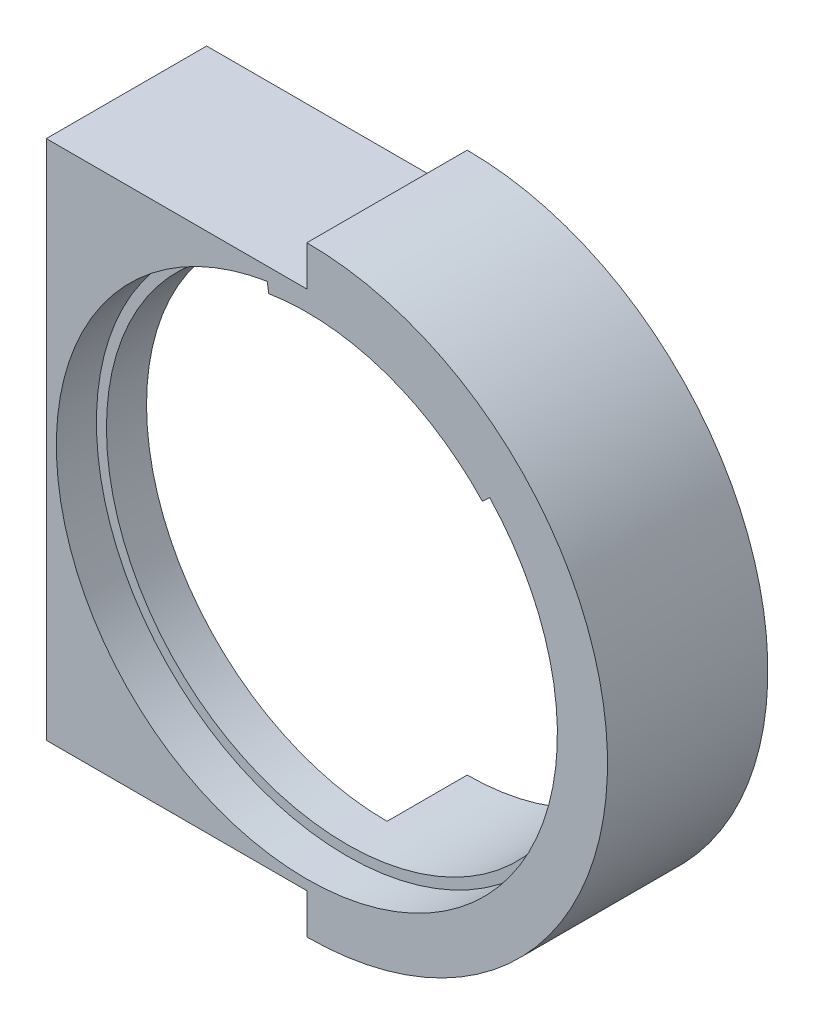
ISO-10303-21;
HEADER;
FILE_DESCRIPTION(('STEP AP214'),'2;1');
FILE_NAME('part.step','',(''),(''),'','','');
FILE_SCHEMA(('AUTOMOTIVE_DESIGN { 1 0 10303 214 1 1 1 1 }'));
ENDSEC;
DATA;
#1=APPLICATION_CONTEXT('core data for automotive mechanical design processes');
#2=APPLICATION_PROTOCOL_DEFINITION('international standard','automotive_design',2000,#1);
#3=PRODUCT_CONTEXT('',#1,'mechanical');
#4=PRODUCT('Part','Part','',(#3));
#5=PRODUCT_RELATED_PRODUCT_CATEGORY('part','',(#4));
#6=PRODUCT_DEFINITION_FORMATION('','',#4);
#7=PRODUCT_DEFINITION_CONTEXT('part definition',#1,'design');
#8=PRODUCT_DEFINITION('design','',#6,#7);
#9=PRODUCT_DEFINITION_SHAPE('','',#8);
#10=(LENGTH_UNIT() NAMED_UNIT(*) SI_UNIT(.MILLI.,.METRE.));
#11=(NAMED_UNIT(*) PLANE_ANGLE_UNIT() SI_UNIT($,.RADIAN.));
#12=(NAMED_UNIT(*) SI_UNIT($,.STERADIAN.) SOLID_ANGLE_UNIT());
#13=UNCERTAINTY_MEASURE_WITH_UNIT(LENGTH_MEASURE(1.E-05),#10,'distance_accuracy_value','');
#14=(GEOMETRIC_REPRESENTATION_CONTEXT(3) GLOBAL_UNCERTAINTY_ASSIGNED_CONTEXT((#13)) GLOBAL_UNIT_ASSIGNED_CONTEXT((#10,
#11,#12)) REPRESENTATION_CONTEXT('',''));
#15=CARTESIAN_POINT('',(0.,0.,0.));
#16=DIRECTION('',(0.,0.,1.));
#17=DIRECTION('',(1.,0.,0.));
#18=AXIS2_PLACEMENT_3D('',#15,#16,#17);
#19=CARTESIAN_POINT('',(0.,0.,25.4));
#20=DIRECTION('',(0.,0.,-1.));
#21=DIRECTION('',(-1.,0.,0.));
#22=AXIS2_PLACEMENT_3D('',#19,#20,#21);
#23=CYLINDRICAL_SURFACE('',#22,38.1);
#24=CARTESIAN_POINT('',(0.,0.,0.));
#25=DIRECTION('',(0.,0.,1.));
#26=DIRECTION('',(1.,0.,0.));
#27=AXIS2_PLACEMENT_3D('',#24,#25,#26);
#28=CIRCLE('',#27,38.1);
#29=CARTESIAN_POINT('',(0.,-38.1,0.));
#30=VERTEX_POINT('',#29);
#31=CARTESIAN_POINT('',(-0.680386241646036,38.0939243785958,0.));
#32=VERTEX_POINT('',#31);
#33=EDGE_CURVE('E182',#30,#32,#28,.T.);
#34=ORIENTED_EDGE('',*,*,#33,.F.);
#35=DIRECTION('',(0.,0.,-1.));
#36=VECTOR('',#35,1.);
#37=CARTESIAN_POINT('',(0.,-38.1,25.4));
#38=LINE('',#37,#36);
#39=CARTESIAN_POINT('',(0.,-38.1,12.7000000000002));
#40=VERTEX_POINT('',#39);
#41=EDGE_CURVE('E283',#40,#30,#38,.T.);
#42=ORIENTED_EDGE('',*,*,#41,.F.);
#43=CARTESIAN_POINT('',(0.,0.,12.7000000000002));
#44=DIRECTION('',(0.,0.,1.));
#45=DIRECTION('',(1.,0.,0.));
#46=AXIS2_PLACEMENT_3D('',#43,#44,#45);
#47=CIRCLE('',#46,38.1);
#48=CARTESIAN_POINT('',(-3.9648671603491,37.8931369564567,12.7000000000002));
#49=VERTEX_POINT('',#48);
#50=EDGE_CURVE('E139',#49,#40,#47,.T.);
#51=ORIENTED_EDGE('',*,*,#50,.F.);
#52=CARTESIAN_POINT('',(26.8856349789663,26.9957891490096,12.7));
#53=CARTESIAN_POINT('',(26.8856130624869,26.9958203141158,12.185407876717));
#54=CARTESIAN_POINT('',(26.8531953918924,27.0282155931077,11.6706248201491));
#55=CARTESIAN_POINT('',(26.7253267500051,27.1546411463514,10.6566729039147));
#56=CARTESIAN_POINT('',(26.6298318711348,27.2487143538144,10.1575151746075));
#57=CARTESIAN_POINT('',(26.3814354013011,27.4892573527077,9.19031532186713));
#58=CARTESIAN_POINT('',(26.2288436110121,27.635444183306,8.72212104290788));
#59=CARTESIAN_POINT('',(25.8723366367366,27.9694748123886,7.82159959786065));
#60=CARTESIAN_POINT('',(25.668399195453,28.1573366719423,7.38928809456735));
#61=CARTESIAN_POINT('',(25.279259808139,28.5064370599518,6.68068746513691));
#62=CARTESIAN_POINT('',(25.1048667690821,28.6603472945983,6.39466505302149));
#63=CARTESIAN_POINT('',(24.734870934671,28.9802681219278,5.84373608080254));
#64=CARTESIAN_POINT('',(24.5392609058967,29.1462828349776,5.57883677585674));
#65=CARTESIAN_POINT('',(24.128493630942,29.4872371734771,5.07002737308718));
#66=CARTESIAN_POINT('',(23.9133049952269,29.6621909264141,4.82615224613171));
#67=CARTESIAN_POINT('',(23.4653308029473,30.0178297666854,4.35962930294656));
#68=CARTESIAN_POINT('',(23.2325412572298,30.1985161478713,4.1369863248827));
#69=CARTESIAN_POINT('',(22.6822899038413,30.6149330368719,3.65214915363539));
#70=CARTESIAN_POINT('',(22.3595962535485,30.8516834373091,3.39675142679292));
#71=CARTESIAN_POINT('',(21.6905711426605,31.3256657538082,2.91953311109929));
#72=CARTESIAN_POINT('',(21.3442333168573,31.5628977827184,2.69772161606774));
#73=CARTESIAN_POINT('',(20.6304531936145,32.0340022388839,2.28670899344449));
#74=CARTESIAN_POINT('',(20.2630055530722,32.2678737966783,2.09751617087556));
#75=CARTESIAN_POINT('',(19.5094955711118,32.7289580824562,1.75093853721087));
#76=CARTESIAN_POINT('',(19.1234345005585,32.9561712633537,1.59355155831355));
#77=CARTESIAN_POINT('',(18.3296155947685,33.4042768636396,1.30789301085951));
#78=CARTESIAN_POINT('',(17.9216358867559,33.6250432854206,1.18004119416452));
#79=CARTESIAN_POINT('',(17.0911133240894,34.0546980904063,0.955556192401849));
#80=CARTESIAN_POINT('',(16.6685703742135,34.2635863959219,0.858923211501906));
#81=CARTESIAN_POINT('',(15.8112396158564,34.6675527431919,0.696401114114196));
#82=CARTESIAN_POINT('',(15.3764536706345,34.8626328707011,0.630507345959938));
#83=CARTESIAN_POINT('',(14.4968428569615,35.2374823544586,0.529109115272313));
#84=CARTESIAN_POINT('',(14.0520173773697,35.4172507754339,0.493606507901438));
#85=CARTESIAN_POINT('',(13.0983931721136,35.7817576825807,0.45026156961757));
#86=CARTESIAN_POINT('',(12.5885639425939,35.9642952350893,0.446443653310207));
#87=CARTESIAN_POINT('',(11.5625850487894,36.3071514254451,0.477053605133833));
#88=CARTESIAN_POINT('',(11.0464348266601,36.4674680866334,0.511484873267205));
#89=CARTESIAN_POINT('',(10.0109700921975,36.7652138136728,0.61886908592755));
#90=CARTESIAN_POINT('',(9.49165294666158,36.9026199939328,0.691860248741613));
#91=CARTESIAN_POINT('',(8.45429989927809,37.1539987275029,0.876848994404707));
#92=CARTESIAN_POINT('',(7.93626395246284,37.2679721151306,0.988845188108683));
#93=CARTESIAN_POINT('',(6.89784530635305,37.4741797487549,1.25457116025375));
#94=CARTESIAN_POINT('',(6.37754697606203,37.5660565648257,1.40891042097622));
#95=CARTESIAN_POINT('',(5.34746091323999,37.7264675659869,1.75958250977437));
#96=CARTESIAN_POINT('',(4.83767486182436,37.7949980443327,1.95592199826135));
#97=CARTESIAN_POINT('',(3.83496177679805,37.9098589605609,2.39154911691317));
#98=CARTESIAN_POINT('',(3.34201332151935,37.9562186626053,2.63077955645708));
#99=CARTESIAN_POINT('',(2.37885729156626,38.0287248441792,3.15375993857702));
#100=CARTESIAN_POINT('',(1.90863841451823,38.0548814687423,3.43748745059363));
#101=CARTESIAN_POINT('',(1.14991969853649,38.0838593966479,3.94886939673094));
#102=CARTESIAN_POINT('',(0.852976840764505,38.0915475949351,4.16380744245146));
#103=CARTESIAN_POINT('',(0.275241301638508,38.1000997415538,4.61456233018817));
#104=CARTESIAN_POINT('',(-0.0055532170877828,38.1009644677971,4.85037678908349));
#105=CARTESIAN_POINT('',(-0.547609681408257,38.0970277029929,5.34279614850971));
#106=CARTESIAN_POINT('',(-0.808896953162967,38.0922336996177,5.5993731578293));
#107=CARTESIAN_POINT('',(-1.30890845835145,38.0783308266459,6.13356576487246));
#108=CARTESIAN_POINT('',(-1.54763717164568,38.0692228159288,6.41117716560273));
#109=CARTESIAN_POINT('',(-1.95146082876751,38.0504101378134,6.92667643515336));
#110=CARTESIAN_POINT('',(-2.1215073899667,38.0412296864402,7.16071125903609));
#111=CARTESIAN_POINT('',(-2.44304319432196,38.0219340524797,7.64114137380283));
#112=CARTESIAN_POINT('',(-2.59453666480493,38.0118190837474,7.88753383089489));
#113=CARTESIAN_POINT('',(-2.87686067856302,37.9914953907604,8.39192064363052));
#114=CARTESIAN_POINT('',(-3.00769124923284,37.9812866666301,8.64991498389184));
#115=CARTESIAN_POINT('',(-3.24648502053791,37.9616213577386,9.17618535745356));
#116=CARTESIAN_POINT('',(-3.35446006568692,37.9521643849888,9.44445597968308));
#117=CARTESIAN_POINT('',(-3.54647854517224,37.9347056751876,9.99227998162698));
#118=CARTESIAN_POINT('',(-3.63029397525796,37.9267180446802,10.2719141358425));
#119=CARTESIAN_POINT('',(-3.77083572165626,37.9130029416352,10.8378422992218));
#120=CARTESIAN_POINT('',(-3.82757550713881,37.9072743455552,11.1241329225359));
#121=CARTESIAN_POINT('',(-3.91267592046346,37.8985862972542,11.7008579396287));
#122=CARTESIAN_POINT('',(-3.94104869976284,37.8956256593699,11.9912905050174));
#123=CARTESIAN_POINT('',(-3.9687980183205,37.8927265129661,12.5734486711237));
#124=CARTESIAN_POINT('',(-3.96817828186645,37.8927876162834,12.8651741009501));
#125=CARTESIAN_POINT('',(-3.92678075226503,37.8971219088607,13.6589864548718));
#126=CARTESIAN_POINT('',(-3.85713699654486,37.9044248431061,14.1598284380907));
#127=CARTESIAN_POINT('',(-3.63586439055025,37.9262742837303,15.1424362798285));
#128=CARTESIAN_POINT('',(-3.48422487441962,37.9408217324427,15.6241996478851));
#129=CARTESIAN_POINT('',(-3.10626352113624,37.9736397509014,16.5639847231723));
#130=CARTESIAN_POINT('',(-2.87903622730964,37.9919543790952,17.0216365923245));
#131=CARTESIAN_POINT('',(-2.36203328453058,38.02759041094,17.9001026299008));
#132=CARTESIAN_POINT('',(-2.0722254896749,38.044911298324,18.3208977092604));
#133=CARTESIAN_POINT('',(-1.52311974011346,38.0702647741135,19.0187521862116));
#134=CARTESIAN_POINT('',(-1.27522410209617,38.079540745914,19.3048960082397));
#135=CARTESIAN_POINT('',(-0.755449168032037,38.0933964827409,19.8547982459686));
#136=CARTESIAN_POINT('',(-0.483561099344128,38.0979745222143,20.1185484038615));
#137=CARTESIAN_POINT('',(0.0808239883445852,38.1009611860258,20.623945903524));
#138=CARTESIAN_POINT('',(0.373355692036851,38.0993591723313,20.8655543994545));
#139=CARTESIAN_POINT('',(0.975367239217991,38.0887038459723,21.3265049031104));
#140=CARTESIAN_POINT('',(1.28485084195711,38.0796488742453,21.5458419408941));
#141=CARTESIAN_POINT('',(2.00493078283205,38.0493525011849,22.0199840867092));
#142=CARTESIAN_POINT('',(2.41992724523188,38.0254444908528,22.2679540956832));
#143=CARTESIAN_POINT('',(3.26757198125365,37.9620041609988,22.7293639513158));
#144=CARTESIAN_POINT('',(3.70022482916255,37.9224677692491,22.9427947777865));
#145=CARTESIAN_POINT('',(4.57874607017518,37.8264506444961,23.3361118425489));
#146=CARTESIAN_POINT('',(5.02461666319892,37.7699670764264,23.5159924601082));
#147=CARTESIAN_POINT('',(5.92556511129333,37.6391405903743,23.8430419286999));
#148=CARTESIAN_POINT('',(6.38064235343463,37.564798857733,23.9902129495942));
#149=CARTESIAN_POINT('',(7.30203130447004,37.3966877367358,24.2541757917493));
#150=CARTESIAN_POINT('',(7.76841227187277,37.3026971504039,24.3705842301512));
#151=CARTESIAN_POINT('',(8.70381339225897,37.0955943734628,24.5712972645771));
#152=CARTESIAN_POINT('',(9.17283356248913,36.9824820577561,24.6556016505593));
#153=CARTESIAN_POINT('',(10.110445884098,36.7372244920581,24.7925366662192));
#154=CARTESIAN_POINT('',(10.5790380844894,36.6050817995539,24.8451715470394));
#155=CARTESIAN_POINT('',(11.5130632675134,36.3221357386073,24.919060120164));
#156=CARTESIAN_POINT('',(11.978496070492,36.1713313182178,24.9403120425614));
#157=CARTESIAN_POINT('',(12.9553641885179,35.8338462212493,24.9521680139822));
#158=CARTESIAN_POINT('',(13.4661152145833,35.6450391602305,24.939074022802));
#159=CARTESIAN_POINT('',(14.476958999156,35.2466007100263,24.8741261045055));
#160=CARTESIAN_POINT('',(14.9770508493243,35.0369675546601,24.8222688875923));
#161=CARTESIAN_POINT('',(15.9637215874501,34.5985736673404,24.6793824183233));
#162=CARTESIAN_POINT('',(16.4502855626352,34.3697928609221,24.5883116291638));
#163=CARTESIAN_POINT('',(17.4060261029714,33.8957926152409,24.3664069814876));
#164=CARTESIAN_POINT('',(17.8752034540633,33.6505739204433,24.2355749227958));
#165=CARTESIAN_POINT('',(18.7955031595279,33.1453786879407,23.9324431446848));
#166=CARTESIAN_POINT('',(19.2465084243494,32.8853265443326,23.7599131356977));
#167=CARTESIAN_POINT('',(20.1242855937665,32.3556159563243,23.372615748888));
#168=CARTESIAN_POINT('',(20.5510532751648,32.0859558510564,23.1578410391992));
#169=CARTESIAN_POINT('',(21.3759336229307,31.5424008010521,22.6851282672663));
#170=CARTESIAN_POINT('',(21.7740926536245,31.2685136241401,22.4272624045326));
#171=CARTESIAN_POINT('',(22.5384170257488,30.7221428192273,21.8667090843721));
#172=CARTESIAN_POINT('',(22.9046007881438,30.4496584693531,21.5640477081636));
#173=CARTESIAN_POINT('',(23.4759439995281,30.0094966599881,21.029184912733));
#174=CARTESIAN_POINT('',(23.6918428596181,29.839199341691,20.8105140045276));
#175=CARTESIAN_POINT('',(24.1072644788232,29.504590035755,20.3538472987036));
#176=CARTESIAN_POINT('',(24.3067893234198,29.340277287377,20.115853969796));
#177=CARTESIAN_POINT('',(24.6877104423016,29.0204885807149,19.6207342932869));
#178=CARTESIAN_POINT('',(24.8691272864527,28.8650026841847,19.3636302476784));
#179=CARTESIAN_POINT('',(25.2123731775952,28.5656799800261,18.8302524532336));
#180=CARTESIAN_POINT('',(25.374206015786,28.4218409195172,18.5539824310159));
#181=CARTESIAN_POINT('',(25.6467050402554,28.1759347901525,18.0390651443359));
#182=CARTESIAN_POINT('',(25.7611764186394,28.071213860378,17.8036942692136));
#183=CARTESIAN_POINT('',(25.9752278862582,27.8732628072171,17.321641784712));
#184=CARTESIAN_POINT('',(26.0748110948595,27.7800302775049,17.0749625588483));
#185=CARTESIAN_POINT('',(26.2579490501834,27.6069918084498,16.5714549974772));
#186=CARTESIAN_POINT('',(26.3415213160984,27.5271712056607,16.3146381301396));
#187=CARTESIAN_POINT('',(26.491727526549,27.3826440987593,15.7920394118844));
#188=CARTESIAN_POINT('',(26.5583649367639,27.3179345024345,15.5262594078832));
#189=CARTESIAN_POINT('',(26.7047360268953,27.1750391078171,14.8426631679112));
#190=CARTESIAN_POINT('',(26.7723485373645,27.1082171452542,14.4197041806309));
#191=CARTESIAN_POINT('',(26.8628048431056,27.0185814106168,13.5645410620483));
#192=CARTESIAN_POINT('',(26.885653392239,26.9957629654429,13.1323379173895));
#193=CARTESIAN_POINT('',(26.8856349789663,26.9957891490096,12.7));
#194=B_SPLINE_CURVE_WITH_KNOTS('',3,(#52,#53,#54,#55,#56,#57,#58,#59,#60,#61,#62,#63,#64,#65,
#66,#67,#68,#69,#70,#71,#72,#73,#74,#75,#76,#77,#78,#79,#80,#81,#82,#83,#84,#85,#86,#87,#88,#89,
#90,#91,#92,#93,#94,#95,#96,#97,#98,#99,#100,#101,#102,#103,#104,#105,#106,#107,#108,#109,#110,
#111,#112,#113,#114,#115,#116,#117,#118,#119,#120,#121,#122,#123,#124,#125,#126,#127,#128,#129,
#130,#131,#132,#133,#134,#135,#136,#137,#138,#139,#140,#141,#142,#143,#144,#145,#146,#147,#148,
#149,#150,#151,#152,#153,#154,#155,#156,#157,#158,#159,#160,#161,#162,#163,#164,#165,#166,#167,
#168,#169,#170,#171,#172,#173,#174,#175,#176,#177,#178,#179,#180,#181,#182,#183,#184,#185,#186,
#187,#188,#189,#190,#191,#192,#193),.UNSPECIFIED.,.T.,.F.,(4,2,2,2,2,2,2,2,2,2,2,2,2,2,2,2,2,2,
2,2,2,2,2,2,2,2,2,2,2,2,2,2,2,2,2,2,2,2,2,2,2,2,2,2,2,2,2,2,2,2,2,2,2,2,2,2,2,2,2,2,2,2,2,2,2,2,
2,2,2,2,4),(0.,1.54216035929018,3.08539533786694,4.62037555542314,6.15602230479725,
7.26062549382172,8.36560646138829,9.47239131119919,10.5794277642346,12.0017716525832,
13.4244999692373,14.8475899927518,16.2705829895049,17.7127014973397,19.1548294362791,
20.5967390717729,22.0387367192378,23.6614635245091,25.2843345868829,26.9088171692257,
28.533241902333,30.1824005892265,31.8318209944306,33.479058208188,35.1254677182936,
36.2245350105084,37.3234770014502,38.4209664929236,39.5182375760197,40.3857637807837,
41.2530919502443,42.1204189697988,42.9872954044347,43.8621034262165,44.7364758072777,
45.6104734763692,46.4843588747686,47.9935278829594,49.5028932482924,51.0310324657484,
52.5599585220417,53.694638943955,54.8297359855777,55.9667877972669,57.1040927903495,
58.55417608399,60.0046374696355,61.4553416360918,62.9059495382025,64.3738637450099,
65.8417875555288,67.3095142759408,68.777323768685,70.4094820870723,72.0417789408626,
73.6758090677949,75.3097652400873,76.9529603651265,78.5964409303316,80.2371949467367,
81.8769974004524,82.9301445267125,83.983157309722,85.0349599693976,86.0865586874367,
86.9314907802042,87.7762455941215,88.6200707299724,89.4637230396321,90.7595167087105,
92.0551727591035),.UNSPECIFIED.);
#195=CARTESIAN_POINT('',(-0.680386241647449,38.0939243785958,5.47838110250661));
#196=VERTEX_POINT('',#195);
#197=EDGE_CURVE('E175',#49,#196,#194,.T.);
#198=ORIENTED_EDGE('',*,*,#197,.T.);
#199=DIRECTION('',(0.,0.,-1.));
#200=VECTOR('',#199,1.);
#201=CARTESIAN_POINT('',(-0.680386241646036,38.0939243785958,6.35000000000011));
#202=LINE('',#201,#200);
#203=EDGE_CURVE('E49',#32,#196,#202,.F.);
#204=ORIENTED_EDGE('',*,*,#203,.F.);
#205=EDGE_LOOP('',(#34,#42,#51,#198,#204));
#206=FACE_BOUND('',#205,.T.);
#207=DIRECTION('',(0.,0.,-1.));
#208=VECTOR('',#207,1.);
#209=CARTESIAN_POINT('',(27.7983624207513,26.0549620365212,25.4));
#210=LINE('',#209,#208);
#211=CARTESIAN_POINT('',(27.7983624207513,26.0549620365212,25.4));
#212=VERTEX_POINT('',#211);
#213=CARTESIAN_POINT('',(27.7983624207513,26.0549620365212,19.05));
#214=VERTEX_POINT('',#213);
#215=EDGE_CURVE('E183',#212,#214,#210,.T.);
#216=ORIENTED_EDGE('',*,*,#215,.F.);
#217=CARTESIAN_POINT('',(0.,0.,25.4));
#218=DIRECTION('',(0.,0.,1.));
#219=DIRECTION('',(1.,0.,0.));
#220=AXIS2_PLACEMENT_3D('',#217,#218,#219);
#221=CIRCLE('',#220,38.1);
#222=CARTESIAN_POINT('',(-6.0346613614472,37.6190491938945,25.4));
#223=VERTEX_POINT('',#222);
#224=EDGE_CURVE('E233',#212,#223,#221,.T.);
#225=ORIENTED_EDGE('',*,*,#224,.T.);
#226=DIRECTION('',(0.,0.,-1.));
#227=VECTOR('',#226,1.);
#228=CARTESIAN_POINT('',(-6.0346613614472,37.6190491938945,25.4));
#229=LINE('',#228,#227);
#230=CARTESIAN_POINT('',(-6.0346613614472,37.6190491938945,19.05));
#231=VERTEX_POINT('',#230);
#232=EDGE_CURVE('E57',#231,#223,#229,.F.);
#233=ORIENTED_EDGE('',*,*,#232,.F.);
#234=CARTESIAN_POINT('',(0.,0.,19.05));
#235=DIRECTION('',(0.,0.,1.));
#236=DIRECTION('',(1.,0.,0.));
#237=AXIS2_PLACEMENT_3D('',#234,#235,#236);
#238=CIRCLE('',#237,38.1);
#239=EDGE_CURVE('E200',#231,#214,#238,.T.);
#240=ORIENTED_EDGE('',*,*,#239,.T.);
#241=EDGE_LOOP('',(#216,#225,#233,#240));
#242=FACE_BOUND('',#241,.T.);
#243=ADVANCED_FACE('F34',(#206,#242),#23,.F.);
#244=CARTESIAN_POINT('',(0.,0.,25.4));
#245=DIRECTION('',(0.,0.,1.));
#246=DIRECTION('',(1.,0.,0.));
#247=AXIS2_PLACEMENT_3D('',#244,#245,#246);
#248=PLANE('',#247);
#249=DIRECTION('',(-0.729615811568277,-0.683857271299768,0.));
#250=VECTOR('',#249,1.);
#251=CARTESIAN_POINT('',(0.,0.,25.4));
#252=LINE('',#251,#250);
#253=CARTESIAN_POINT('',(28.956627521616,27.1405854547095,25.4));
#254=VERTEX_POINT('',#253);
#255=EDGE_CURVE('E241',#254,#212,#252,.T.);
#256=ORIENTED_EDGE('',*,*,#255,.F.);
#257=CARTESIAN_POINT('',(0.,0.,25.4));
#258=DIRECTION('',(0.,0.,1.));
#259=DIRECTION('',(1.,0.,0.));
#260=AXIS2_PLACEMENT_3D('',#257,#258,#259);
#261=CIRCLE('',#260,39.6875);
#262=CARTESIAN_POINT('',(-6.28610558484084,39.1865095769735,25.4));
#263=VERTEX_POINT('',#262);
#264=EDGE_CURVE('E293',#263,#254,#261,.T.);
#265=ORIENTED_EDGE('',*,*,#264,.F.);
#266=DIRECTION('',(-0.158390061980242,0.987376619262323,0.));
#267=VECTOR('',#266,1.);
#268=CARTESIAN_POINT('',(0.,0.,25.4));
#269=LINE('',#268,#267);
#270=EDGE_CURVE('E174',#223,#263,#269,.T.);
#271=ORIENTED_EDGE('',*,*,#270,.F.);
#272=ORIENTED_EDGE('',*,*,#224,.F.);
#273=EDGE_LOOP('',(#256,#265,#271,#272));
#274=FACE_BOUND('',#273,.T.);
#275=DIRECTION('',(0.,-1.,0.));
#276=VECTOR('',#275,1.);
#277=CARTESIAN_POINT('',(0.,47.625,25.4));
#278=LINE('',#277,#276);
#279=CARTESIAN_POINT('',(0.,47.625,25.4));
#280=VERTEX_POINT('',#279);
#281=CARTESIAN_POINT('',(0.,41.275,25.4));
#282=VERTEX_POINT('',#281);
#283=EDGE_CURVE('E250',#280,#282,#278,.T.);
#284=ORIENTED_EDGE('',*,*,#283,.T.);
#285=DIRECTION('',(-1.,0.,0.));
#286=VECTOR('',#285,1.);
#287=CARTESIAN_POINT('',(-41.275,41.275,25.4));
#288=LINE('',#287,#286);
#289=CARTESIAN_POINT('',(-41.275,41.275,25.4));
#290=VERTEX_POINT('',#289);
#291=EDGE_CURVE('E253',#282,#290,#288,.T.);
#292=ORIENTED_EDGE('',*,*,#291,.T.);
#293=DIRECTION('',(0.,-1.,0.));
#294=VECTOR('',#293,1.);
#295=CARTESIAN_POINT('',(-41.275,-41.275,25.4));
#296=LINE('',#295,#294);
#297=CARTESIAN_POINT('',(-41.275,-41.275,25.4));
#298=VERTEX_POINT('',#297);
#299=EDGE_CURVE('E256',#290,#298,#296,.T.);
#300=ORIENTED_EDGE('',*,*,#299,.T.);
#301=DIRECTION('',(1.,0.,0.));
#302=VECTOR('',#301,1.);
#303=CARTESIAN_POINT('',(-41.275,-41.275,25.4));
#304=LINE('',#303,#302);
#305=CARTESIAN_POINT('',(0.,-41.275,25.4));
#306=VERTEX_POINT('',#305);
#307=EDGE_CURVE('E258',#298,#306,#304,.T.);
#308=ORIENTED_EDGE('',*,*,#307,.T.);
#309=DIRECTION('',(0.,-1.,0.));
#310=VECTOR('',#309,1.);
#311=CARTESIAN_POINT('',(0.,-47.625,25.4));
#312=LINE('',#311,#310);
#313=CARTESIAN_POINT('',(0.,-47.625,25.4));
#314=VERTEX_POINT('',#313);
#315=EDGE_CURVE('E159',#306,#314,#312,.T.);
#316=ORIENTED_EDGE('',*,*,#315,.T.);
#317=CARTESIAN_POINT('',(0.,0.,25.4));
#318=DIRECTION('',(0.,0.,1.));
#319=DIRECTION('',(1.,0.,0.));
#320=AXIS2_PLACEMENT_3D('',#317,#318,#319);
#321=CIRCLE('',#320,47.625);
#322=EDGE_CURVE('E261',#314,#280,#321,.T.);
#323=ORIENTED_EDGE('',*,*,#322,.T.);
#324=EDGE_LOOP('',(#284,#292,#300,#308,#316,#323));
#325=FACE_BOUND('',#324,.T.);
#326=ADVANCED_FACE('F219',(#274,#325),#248,.T.);
#327=CARTESIAN_POINT('',(0.,0.,0.));
#328=DIRECTION('',(0.,0.,1.));
#329=DIRECTION('',(1.,0.,0.));
#330=AXIS2_PLACEMENT_3D('',#327,#328,#329);
#331=PLANE('',#330);
#332=DIRECTION('',(0.,-1.,0.));
#333=VECTOR('',#332,1.);
#334=CARTESIAN_POINT('',(0.,-47.625,0.));
#335=LINE('',#334,#333);
#336=CARTESIAN_POINT('',(0.,-47.625,0.));
#337=VERTEX_POINT('',#336);
#338=EDGE_CURVE('E265',#30,#337,#335,.T.);
#339=ORIENTED_EDGE('',*,*,#338,.F.);
#340=ORIENTED_EDGE('',*,*,#33,.T.);
#341=CARTESIAN_POINT('',(-2.46407045019677,275.942084147442,0.));
#342=DIRECTION('',(0.,0.,1.));
#343=DIRECTION('',(-1.,0.,0.));
#344=AXIS2_PLACEMENT_3D('',#341,#342,#343);
#345=CIRCLE('',#344,237.854847826951);
#346=CARTESIAN_POINT('',(-41.275,41.275,0.));
#347=VERTEX_POINT('',#346);
#348=EDGE_CURVE('E144',#347,#32,#345,.T.);
#349=ORIENTED_EDGE('',*,*,#348,.F.);
#350=DIRECTION('',(-1.,0.,0.));
#351=VECTOR('',#350,1.);
#352=CARTESIAN_POINT('',(-41.275,41.275,0.));
#353=LINE('',#352,#351);
#354=CARTESIAN_POINT('',(0.,41.275,0.));
#355=VERTEX_POINT('',#354);
#356=EDGE_CURVE('E245',#355,#347,#353,.T.);
#357=ORIENTED_EDGE('',*,*,#356,.F.);
#358=DIRECTION('',(0.,-1.,0.));
#359=VECTOR('',#358,1.);
#360=CARTESIAN_POINT('',(0.,47.625,0.));
#361=LINE('',#360,#359);
#362=CARTESIAN_POINT('',(0.,47.625,0.));
#363=VERTEX_POINT('',#362);
#364=EDGE_CURVE('E242',#363,#355,#361,.T.);
#365=ORIENTED_EDGE('',*,*,#364,.F.);
#366=CARTESIAN_POINT('',(0.,0.,0.));
#367=DIRECTION('',(0.,0.,1.));
#368=DIRECTION('',(1.,0.,0.));
#369=AXIS2_PLACEMENT_3D('',#366,#367,#368);
#370=CIRCLE('',#369,47.625);
#371=EDGE_CURVE('E254',#337,#363,#370,.T.);
#372=ORIENTED_EDGE('',*,*,#371,.F.);
#373=EDGE_LOOP('',(#339,#340,#349,#357,#365,#372));
#374=FACE_BOUND('',#373,.T.);
#375=ADVANCED_FACE('F224',(#374),#331,.F.);
#376=CARTESIAN_POINT('',(0.,47.625,25.4));
#377=DIRECTION('',(1.,0.,0.));
#378=DIRECTION('',(0.,1.,0.));
#379=AXIS2_PLACEMENT_3D('',#376,#377,#378);
#380=PLANE('',#379);
#381=ORIENTED_EDGE('',*,*,#364,.T.);
#382=DIRECTION('',(0.,0.,-1.));
#383=VECTOR('',#382,1.);
#384=CARTESIAN_POINT('',(0.,41.275,25.4));
#385=LINE('',#384,#383);
#386=EDGE_CURVE('E171',#282,#355,#385,.T.);
#387=ORIENTED_EDGE('',*,*,#386,.F.);
#388=ORIENTED_EDGE('',*,*,#283,.F.);
#389=DIRECTION('',(0.,0.,-1.));
#390=VECTOR('',#389,1.);
#391=CARTESIAN_POINT('',(0.,47.625,25.4));
#392=LINE('',#391,#390);
#393=EDGE_CURVE('E165',#280,#363,#392,.T.);
#394=ORIENTED_EDGE('',*,*,#393,.T.);
#395=EDGE_LOOP('',(#381,#387,#388,#394));
#396=FACE_BOUND('',#395,.T.);
#397=ADVANCED_FACE('F36',(#396),#380,.F.);
#398=CARTESIAN_POINT('',(-41.275,41.275,25.4));
#399=DIRECTION('',(0.,-1.,0.));
#400=DIRECTION('',(0.,0.,-1.));
#401=AXIS2_PLACEMENT_3D('',#398,#399,#400);
#402=PLANE('',#401);
#403=ORIENTED_EDGE('',*,*,#356,.T.);
#404=DIRECTION('',(0.,0.,-1.));
#405=VECTOR('',#404,1.);
#406=CARTESIAN_POINT('',(-41.275,41.275,104.993705771304));
#407=LINE('',#406,#405);
#408=CARTESIAN_POINT('',(-41.275,41.275,12.7000000000002));
#409=VERTEX_POINT('',#408);
#410=EDGE_CURVE('E418',#409,#347,#407,.T.);
#411=ORIENTED_EDGE('',*,*,#410,.F.);
#412=DIRECTION('',(0.,0.,-1.));
#413=VECTOR('',#412,1.);
#414=CARTESIAN_POINT('',(-41.275,41.275,25.4));
#415=LINE('',#414,#413);
#416=EDGE_CURVE('E162',#290,#409,#415,.T.);
#417=ORIENTED_EDGE('',*,*,#416,.F.);
#418=ORIENTED_EDGE('',*,*,#291,.F.);
#419=ORIENTED_EDGE('',*,*,#386,.T.);
#420=EDGE_LOOP('',(#403,#411,#417,#418,#419));
#421=FACE_BOUND('',#420,.T.);
#422=ADVANCED_FACE('F280',(#421),#402,.F.);
#423=CARTESIAN_POINT('',(-41.275,-41.275,25.4));
#424=DIRECTION('',(1.,0.,0.));
#425=DIRECTION('',(0.,0.,-1.));
#426=AXIS2_PLACEMENT_3D('',#423,#424,#425);
#427=PLANE('',#426);
#428=ORIENTED_EDGE('',*,*,#416,.T.);
#429=DIRECTION('',(0.,1.,0.));
#430=VECTOR('',#429,1.);
#431=CARTESIAN_POINT('',(-41.275,-41.275,12.7000000000002));
#432=LINE('',#431,#430);
#433=CARTESIAN_POINT('',(-41.275,-41.275,12.7000000000002));
#434=VERTEX_POINT('',#433);
#435=EDGE_CURVE('E155',#434,#409,#432,.T.);
#436=ORIENTED_EDGE('',*,*,#435,.F.);
#437=DIRECTION('',(0.,0.,-1.));
#438=VECTOR('',#437,1.);
#439=CARTESIAN_POINT('',(-41.275,-41.275,25.4));
#440=LINE('',#439,#438);
#441=EDGE_CURVE('E154',#298,#434,#440,.T.);
#442=ORIENTED_EDGE('',*,*,#441,.F.);
#443=ORIENTED_EDGE('',*,*,#299,.F.);
#444=EDGE_LOOP('',(#428,#436,#442,#443));
#445=FACE_BOUND('',#444,.T.);
#446=ADVANCED_FACE('F355',(#445),#427,.F.);
#447=CARTESIAN_POINT('',(-41.275,-41.275,25.4));
#448=DIRECTION('',(0.,1.,0.));
#449=DIRECTION('',(0.,0.,1.));
#450=AXIS2_PLACEMENT_3D('',#447,#448,#449);
#451=PLANE('',#450);
#452=ORIENTED_EDGE('',*,*,#441,.T.);
#453=DIRECTION('',(-1.,0.,0.));
#454=VECTOR('',#453,1.);
#455=CARTESIAN_POINT('',(0.,-41.275,12.7000000000002));
#456=LINE('',#455,#454);
#457=CARTESIAN_POINT('',(0.,-41.275,12.7000000000002));
#458=VERTEX_POINT('',#457);
#459=EDGE_CURVE('E136',#458,#434,#456,.T.);
#460=ORIENTED_EDGE('',*,*,#459,.F.);
#461=DIRECTION('',(0.,0.,-1.));
#462=VECTOR('',#461,1.);
#463=CARTESIAN_POINT('',(0.,-41.275,25.4));
#464=LINE('',#463,#462);
#465=EDGE_CURVE('E151',#306,#458,#464,.T.);
#466=ORIENTED_EDGE('',*,*,#465,.F.);
#467=ORIENTED_EDGE('',*,*,#307,.F.);
#468=EDGE_LOOP('',(#452,#460,#466,#467));
#469=FACE_BOUND('',#468,.T.);
#470=ADVANCED_FACE('F149',(#469),#451,.F.);
#471=CARTESIAN_POINT('',(0.,-47.625,25.4));
#472=DIRECTION('',(1.,0.,0.));
#473=DIRECTION('',(0.,0.,-1.));
#474=AXIS2_PLACEMENT_3D('',#471,#472,#473);
#475=PLANE('',#474);
#476=ORIENTED_EDGE('',*,*,#338,.T.);
#477=DIRECTION('',(0.,0.,-1.));
#478=VECTOR('',#477,1.);
#479=CARTESIAN_POINT('',(0.,-47.625,25.4));
#480=LINE('',#479,#478);
#481=EDGE_CURVE('E160',#314,#337,#480,.T.);
#482=ORIENTED_EDGE('',*,*,#481,.F.);
#483=ORIENTED_EDGE('',*,*,#315,.F.);
#484=ORIENTED_EDGE('',*,*,#465,.T.);
#485=DIRECTION('',(0.,-1.,0.));
#486=VECTOR('',#485,1.);
#487=CARTESIAN_POINT('',(0.,38.1,12.7000000000002));
#488=LINE('',#487,#486);
#489=EDGE_CURVE('E132',#40,#458,#488,.T.);
#490=ORIENTED_EDGE('',*,*,#489,.F.);
#491=ORIENTED_EDGE('',*,*,#41,.T.);
#492=EDGE_LOOP('',(#476,#482,#483,#484,#490,#491));
#493=FACE_BOUND('',#492,.T.);
#494=ADVANCED_FACE('F157',(#493),#475,.F.);
#495=CARTESIAN_POINT('',(0.,0.,25.4));
#496=DIRECTION('',(0.,0.,-1.));
#497=DIRECTION('',(-1.,0.,0.));
#498=AXIS2_PLACEMENT_3D('',#495,#496,#497);
#499=CYLINDRICAL_SURFACE('',#498,47.625);
#500=ORIENTED_EDGE('',*,*,#371,.T.);
#501=ORIENTED_EDGE('',*,*,#393,.F.);
#502=ORIENTED_EDGE('',*,*,#322,.F.);
#503=ORIENTED_EDGE('',*,*,#481,.T.);
#504=EDGE_LOOP('',(#500,#501,#502,#503));
#505=FACE_BOUND('',#504,.T.);
#506=ADVANCED_FACE('F192',(#505),#499,.T.);
#507=CARTESIAN_POINT('',(6.76783917135641,19.1598213183384,12.7));
#508=DIRECTION('',(-0.33306295134628,-0.942904592437912,0.));
#509=DIRECTION('',(0.942904592437912,-0.33306295134628,0.));
#510=AXIS2_PLACEMENT_3D('',#507,#508,#509);
#511=SPHERICAL_SURFACE('',#510,21.59);
#512=CARTESIAN_POINT('',(6.76783917135641,19.1598213183384,12.7000000000002));
#513=DIRECTION('',(0.,0.,1.));
#514=DIRECTION('',(1.,0.,0.));
#515=AXIS2_PLACEMENT_3D('',#512,#513,#514);
#516=CIRCLE('',#515,21.59);
#517=CARTESIAN_POINT('',(-3.61367740134162,38.0900144935491,12.7000000000002));
#518=VERTEX_POINT('',#517);
#519=EDGE_CURVE('E12',#518,#49,#516,.T.);
#520=ORIENTED_EDGE('',*,*,#519,.F.);
#521=CARTESIAN_POINT('',(0.0002,38.1000020721063,4.85164265206278));
#522=CARTESIAN_POINT('',(-0.219814134418342,38.0977221820825,5.03581730180521));
#523=CARTESIAN_POINT('',(-0.431659778888181,38.0958329758013,5.22970700286095));
#524=CARTESIAN_POINT('',(-0.837651659016064,38.0927104640689,5.63512771507097));
#525=CARTESIAN_POINT('',(-1.03180199520507,38.0914770063393,5.84665461729292));
#526=CARTESIAN_POINT('',(-1.40084956354842,38.0895411286258,6.28529784047901));
#527=CARTESIAN_POINT('',(-1.57577702715449,38.088837864303,6.51238874363649));
#528=CARTESIAN_POINT('',(-1.90565071893572,38.0878346306927,6.98064729854563));
#529=CARTESIAN_POINT('',(-2.06059654280488,38.0875346695644,7.22181523498685));
#530=CARTESIAN_POINT('',(-2.34952367837891,38.087220018967,7.71629175030733));
#531=CARTESIAN_POINT('',(-2.48351144893373,38.0872052414376,7.96959655728637));
#532=CARTESIAN_POINT('',(-2.72981016574037,38.0873528802811,8.48653547455408));
#533=CARTESIAN_POINT('',(-2.84212057316088,38.087515301058,8.75016984140735));
#534=CARTESIAN_POINT('',(-3.04439169876967,38.087922715071,9.28575058678672));
#535=CARTESIAN_POINT('',(-3.13436170175907,38.0881676739038,9.55769345929871));
#536=CARTESIAN_POINT('',(-3.29150725614024,38.0886627021342,10.1079917757028));
#537=CARTESIAN_POINT('',(-3.35868893281382,38.0889127701393,10.3863454749107));
#538=CARTESIAN_POINT('',(-3.48065740946924,38.0893988810026,11.0018028630385));
#539=CARTESIAN_POINT('',(-3.53055602408981,38.0896229209026,11.3398851254347));
#540=CARTESIAN_POINT('',(-3.59706614194964,38.0899344812938,12.0187268357521));
#541=CARTESIAN_POINT('',(-3.61373414001791,38.0900222334292,12.3594807495126));
#542=CARTESIAN_POINT('',(-3.61367739943193,38.0900144935399,12.7002000000002));
#543=B_SPLINE_CURVE_WITH_KNOTS('',3,(#521,#522,#523,#524,#525,#526,#527,#528,#529,#530,#531,
#532,#533,#534,#535,#536,#537,#538,#539,#540,#541,#542),.UNSPECIFIED.,.F.,.F.,(4,2,2,2,2,2,2,2,
2,2,4),(0.,0.860483109653749,1.72076631000573,2.57967658883643,3.43860424402497,
4.29726667125148,5.15595043938704,6.01427673401553,6.87237213567648,7.89593491449116,
8.91775606196761),.UNSPECIFIED.);
#544=EDGE_CURVE('E42',#196,#518,#543,.T.);
#545=ORIENTED_EDGE('',*,*,#544,.F.);
#546=ORIENTED_EDGE('',*,*,#197,.F.);
#547=EDGE_LOOP('',(#520,#545,#546));
#548=FACE_BOUND('',#547,.T.);
#549=ADVANCED_FACE('F187',(#548),#511,.F.);
#550=CARTESIAN_POINT('',(0.,0.,19.05));
#551=DIRECTION('',(-0.683857271299768,0.729615811568277,0.));
#552=DIRECTION('',(-0.729615811568277,-0.683857271299768,0.));
#553=AXIS2_PLACEMENT_3D('',#550,#551,#552);
#554=PLANE('',#553);
#555=ORIENTED_EDGE('',*,*,#215,.T.);
#556=DIRECTION('',(-0.729615811568277,-0.683857271299768,0.));
#557=VECTOR('',#556,1.);
#558=CARTESIAN_POINT('',(0.,0.,19.05));
#559=LINE('',#558,#557);
#560=CARTESIAN_POINT('',(28.956627521616,27.1405854547095,19.05));
#561=VERTEX_POINT('',#560);
#562=EDGE_CURVE('E290',#561,#214,#559,.T.);
#563=ORIENTED_EDGE('',*,*,#562,.F.);
#564=DIRECTION('',(0.,0.,1.));
#565=VECTOR('',#564,1.);
#566=CARTESIAN_POINT('',(28.956627521616,27.1405854547095,19.05));
#567=LINE('',#566,#565);
#568=EDGE_CURVE('E302',#561,#254,#567,.T.);
#569=ORIENTED_EDGE('',*,*,#568,.T.);
#570=ORIENTED_EDGE('',*,*,#255,.T.);
#571=EDGE_LOOP('',(#555,#563,#569,#570));
#572=FACE_BOUND('',#571,.T.);
#573=ADVANCED_FACE('F191',(#572),#554,.F.);
#574=CARTESIAN_POINT('',(0.,0.,19.05));
#575=DIRECTION('',(0.,0.,1.));
#576=DIRECTION('',(1.,0.,0.));
#577=AXIS2_PLACEMENT_3D('',#574,#575,#576);
#578=CYLINDRICAL_SURFACE('',#577,39.6875);
#579=ORIENTED_EDGE('',*,*,#264,.T.);
#580=ORIENTED_EDGE('',*,*,#568,.F.);
#581=CARTESIAN_POINT('',(0.,0.,19.05));
#582=DIRECTION('',(0.,0.,1.));
#583=DIRECTION('',(1.,0.,0.));
#584=AXIS2_PLACEMENT_3D('',#581,#582,#583);
#585=CIRCLE('',#584,39.6875);
#586=CARTESIAN_POINT('',(-6.28610558484084,39.1865095769735,19.05));
#587=VERTEX_POINT('',#586);
#588=EDGE_CURVE('E295',#587,#561,#585,.T.);
#589=ORIENTED_EDGE('',*,*,#588,.F.);
#590=DIRECTION('',(0.,0.,1.));
#591=VECTOR('',#590,1.);
#592=CARTESIAN_POINT('',(-6.28610558484084,39.1865095769735,19.05));
#593=LINE('',#592,#591);
#594=EDGE_CURVE('E298',#587,#263,#593,.T.);
#595=ORIENTED_EDGE('',*,*,#594,.T.);
#596=EDGE_LOOP('',(#579,#580,#589,#595));
#597=FACE_BOUND('',#596,.T.);
#598=ADVANCED_FACE('F212',(#597),#578,.F.);
#599=CARTESIAN_POINT('',(-6.28610558484084,39.1865095769735,19.05));
#600=DIRECTION('',(0.987376619262323,0.158390061980242,0.));
#601=DIRECTION('',(-0.158390061980242,0.987376619262323,0.));
#602=AXIS2_PLACEMENT_3D('',#599,#600,#601);
#603=PLANE('',#602);
#604=ORIENTED_EDGE('',*,*,#232,.T.);
#605=ORIENTED_EDGE('',*,*,#270,.T.);
#606=ORIENTED_EDGE('',*,*,#594,.F.);
#607=DIRECTION('',(-0.158390061980242,0.987376619262323,0.));
#608=VECTOR('',#607,1.);
#609=CARTESIAN_POINT('',(-6.28610558484084,39.1865095769735,19.05));
#610=LINE('',#609,#608);
#611=EDGE_CURVE('E292',#231,#587,#610,.T.);
#612=ORIENTED_EDGE('',*,*,#611,.F.);
#613=EDGE_LOOP('',(#604,#605,#606,#612));
#614=FACE_BOUND('',#613,.T.);
#615=ADVANCED_FACE('F210',(#614),#603,.F.);
#616=CARTESIAN_POINT('',(0.,0.,19.05));
#617=DIRECTION('',(0.,0.,1.));
#618=DIRECTION('',(1.,0.,0.));
#619=AXIS2_PLACEMENT_3D('',#616,#617,#618);
#620=PLANE('',#619);
#621=ORIENTED_EDGE('',*,*,#611,.T.);
#622=ORIENTED_EDGE('',*,*,#588,.T.);
#623=ORIENTED_EDGE('',*,*,#562,.T.);
#624=ORIENTED_EDGE('',*,*,#239,.F.);
#625=EDGE_LOOP('',(#621,#622,#623,#624));
#626=FACE_BOUND('',#625,.T.);
#627=ADVANCED_FACE('F207',(#626),#620,.T.);
#628=CARTESIAN_POINT('',(-41.2749999999993,-47.625,12.7000000000002));
#629=DIRECTION('',(0.,0.,1.));
#630=DIRECTION('',(1.,0.,0.));
#631=AXIS2_PLACEMENT_3D('',#628,#629,#630);
#632=PLANE('',#631);
#633=ORIENTED_EDGE('',*,*,#50,.T.);
#634=ORIENTED_EDGE('',*,*,#489,.T.);
#635=ORIENTED_EDGE('',*,*,#459,.T.);
#636=ORIENTED_EDGE('',*,*,#435,.T.);
#637=CARTESIAN_POINT('',(-2.46407045019677,275.942084147442,12.7000000000002));
#638=DIRECTION('',(0.,0.,1.));
#639=DIRECTION('',(1.,0.,0.));
#640=AXIS2_PLACEMENT_3D('',#637,#638,#639);
#641=CIRCLE('',#640,237.854847826951);
#642=EDGE_CURVE('E286',#409,#518,#641,.T.);
#643=ORIENTED_EDGE('',*,*,#642,.T.);
#644=ORIENTED_EDGE('',*,*,#519,.T.);
#645=EDGE_LOOP('',(#633,#634,#635,#636,#643,#644));
#646=FACE_BOUND('',#645,.T.);
#647=ADVANCED_FACE('F134',(#646),#632,.F.);
#648=CARTESIAN_POINT('',(-2.46407045019677,275.942084147442,104.993705771304));
#649=DIRECTION('',(0.,0.,-1.));
#650=DIRECTION('',(-1.,0.,0.));
#651=AXIS2_PLACEMENT_3D('',#648,#649,#650);
#652=CYLINDRICAL_SURFACE('',#651,237.854847826951);
#653=ORIENTED_EDGE('',*,*,#203,.T.);
#654=ORIENTED_EDGE('',*,*,#544,.T.);
#655=ORIENTED_EDGE('',*,*,#642,.F.);
#656=ORIENTED_EDGE('',*,*,#410,.T.);
#657=ORIENTED_EDGE('',*,*,#348,.T.);
#658=EDGE_LOOP('',(#653,#654,#655,#656,#657));
#659=FACE_BOUND('',#658,.T.);
#660=ADVANCED_FACE('F201',(#659),#652,.T.);
#661=CLOSED_SHELL('',(#243,#326,#375,#397,#422,#446,#470,#494,#506,#549,#573,#598,#615,#627,
#647,#660));
#662=MANIFOLD_SOLID_BREP('B2',#661);
#663=ADVANCED_BREP_SHAPE_REPRESENTATION('',(#18,#662),#14);
#664=SHAPE_DEFINITION_REPRESENTATION(#9,#663);
ENDSEC;
END-ISO-10303-21;
